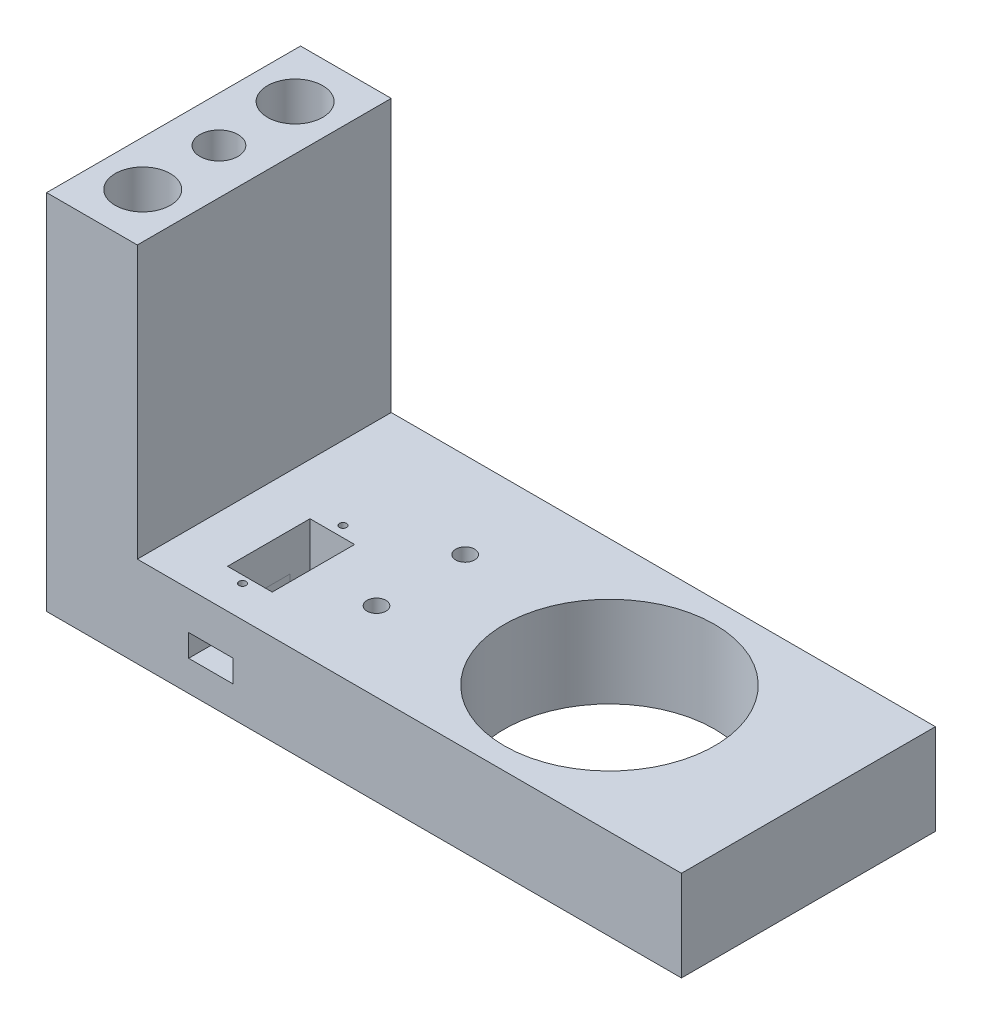
ISO-10303-21;
HEADER;
FILE_DESCRIPTION(('STEP AP214'),'2;1');
FILE_NAME('part.step','',(''),(''),'','','');
FILE_SCHEMA(('AUTOMOTIVE_DESIGN { 1 0 10303 214 1 1 1 1 }'));
ENDSEC;
DATA;
#1=APPLICATION_CONTEXT('core data for automotive mechanical design processes');
#2=APPLICATION_PROTOCOL_DEFINITION('international standard','automotive_design',2000,#1);
#3=PRODUCT_CONTEXT('',#1,'mechanical');
#4=PRODUCT('Part','Part','',(#3));
#5=PRODUCT_RELATED_PRODUCT_CATEGORY('part','',(#4));
#6=PRODUCT_DEFINITION_FORMATION('','',#4);
#7=PRODUCT_DEFINITION_CONTEXT('part definition',#1,'design');
#8=PRODUCT_DEFINITION('design','',#6,#7);
#9=PRODUCT_DEFINITION_SHAPE('','',#8);
#10=(LENGTH_UNIT() NAMED_UNIT(*) SI_UNIT(.MILLI.,.METRE.));
#11=(NAMED_UNIT(*) PLANE_ANGLE_UNIT() SI_UNIT($,.RADIAN.));
#12=(NAMED_UNIT(*) SI_UNIT($,.STERADIAN.) SOLID_ANGLE_UNIT());
#13=UNCERTAINTY_MEASURE_WITH_UNIT(LENGTH_MEASURE(1.E-05),#10,'distance_accuracy_value','');
#14=(GEOMETRIC_REPRESENTATION_CONTEXT(3) GLOBAL_UNCERTAINTY_ASSIGNED_CONTEXT((#13)) GLOBAL_UNIT_ASSIGNED_CONTEXT((#10,
#11,#12)) REPRESENTATION_CONTEXT('',''));
#15=CARTESIAN_POINT('',(0.,0.,0.));
#16=DIRECTION('',(0.,0.,1.));
#17=DIRECTION('',(1.,0.,0.));
#18=AXIS2_PLACEMENT_3D('',#15,#16,#17);
#19=CARTESIAN_POINT('',(162.5,25.,35.));
#20=DIRECTION('',(0.,-1.,0.));
#21=DIRECTION('',(0.,0.,-1.));
#22=AXIS2_PLACEMENT_3D('',#19,#20,#21);
#23=PLANE('',#22);
#24=CARTESIAN_POINT('',(56.60021437,25.,13.16922633));
#25=DIRECTION('',(0.,-1.,0.));
#26=DIRECTION('',(0.,0.,-1.));
#27=AXIS2_PLACEMENT_3D('',#24,#25,#26);
#28=CIRCLE('',#27,2.6);
#29=CARTESIAN_POINT('',(56.60021437,25.,10.56922633));
#30=VERTEX_POINT('',#29);
#31=EDGE_CURVE('E346',#30,#30,#28,.T.);
#32=ORIENTED_EDGE('',*,*,#31,.T.);
#33=EDGE_LOOP('',(#32));
#34=FACE_BOUND('',#33,.T.);
#35=CARTESIAN_POINT('',(56.60021437,25.,-11.27722458));
#36=DIRECTION('',(0.,-1.,0.));
#37=DIRECTION('',(0.,0.,-1.));
#38=AXIS2_PLACEMENT_3D('',#35,#36,#37);
#39=CIRCLE('',#38,2.6);
#40=CARTESIAN_POINT('',(56.60021437,25.,-13.87722458));
#41=VERTEX_POINT('',#40);
#42=EDGE_CURVE('E351',#41,#41,#39,.T.);
#43=ORIENTED_EDGE('',*,*,#42,.T.);
#44=EDGE_LOOP('',(#43));
#45=FACE_BOUND('',#44,.T.);
#46=CARTESIAN_POINT('',(32.8072941842521,25.,-1.39841023109142));
#47=DIRECTION('',(0.,-1.,0.));
#48=DIRECTION('',(0.,0.,-1.));
#49=AXIS2_PLACEMENT_3D('',#46,#47,#48);
#50=CIRCLE('',#49,0.999999999999998);
#51=CARTESIAN_POINT('',(32.8072941842521,25.,-2.39841023109141));
#52=VERTEX_POINT('',#51);
#53=EDGE_CURVE('E197',#52,#52,#50,.T.);
#54=ORIENTED_EDGE('',*,*,#53,.T.);
#55=EDGE_LOOP('',(#54));
#56=FACE_BOUND('',#55,.T.);
#57=CARTESIAN_POINT('',(32.8072941842521,25.,26.3016149524107));
#58=DIRECTION('',(0.,-1.,0.));
#59=DIRECTION('',(0.,0.,-1.));
#60=AXIS2_PLACEMENT_3D('',#57,#58,#59);
#61=CIRCLE('',#60,0.999999999999998);
#62=CARTESIAN_POINT('',(32.8072941842521,25.,25.3016149524107));
#63=VERTEX_POINT('',#62);
#64=EDGE_CURVE('E192',#63,#63,#61,.T.);
#65=ORIENTED_EDGE('',*,*,#64,.T.);
#66=EDGE_LOOP('',(#65));
#67=FACE_BOUND('',#66,.T.);
#68=DIRECTION('',(0.,0.,1.));
#69=VECTOR('',#68,1.);
#70=CARTESIAN_POINT('',(12.5,25.,35.));
#71=LINE('',#70,#69);
#72=CARTESIAN_POINT('',(12.5,25.,-35.));
#73=VERTEX_POINT('',#72);
#74=CARTESIAN_POINT('',(12.5,25.,35.));
#75=VERTEX_POINT('',#74);
#76=EDGE_CURVE('E245',#73,#75,#71,.T.);
#77=ORIENTED_EDGE('',*,*,#76,.T.);
#78=DIRECTION('',(-1.,0.,0.));
#79=VECTOR('',#78,1.);
#80=CARTESIAN_POINT('',(162.5,25.,35.));
#81=LINE('',#80,#79);
#82=CARTESIAN_POINT('',(162.5,25.,35.));
#83=VERTEX_POINT('',#82);
#84=EDGE_CURVE('E252',#83,#75,#81,.T.);
#85=ORIENTED_EDGE('',*,*,#84,.F.);
#86=DIRECTION('',(0.,0.,1.));
#87=VECTOR('',#86,1.);
#88=CARTESIAN_POINT('',(162.5,25.,35.));
#89=LINE('',#88,#87);
#90=CARTESIAN_POINT('',(162.5,25.,-35.));
#91=VERTEX_POINT('',#90);
#92=EDGE_CURVE('E250',#91,#83,#89,.T.);
#93=ORIENTED_EDGE('',*,*,#92,.F.);
#94=DIRECTION('',(-1.,0.,0.));
#95=VECTOR('',#94,1.);
#96=CARTESIAN_POINT('',(162.5,25.,-35.));
#97=LINE('',#96,#95);
#98=EDGE_CURVE('E257',#91,#73,#97,.T.);
#99=ORIENTED_EDGE('',*,*,#98,.T.);
#100=EDGE_LOOP('',(#77,#85,#93,#99));
#101=FACE_BOUND('',#100,.T.);
#102=CARTESIAN_POINT('',(107.66,25.,0.));
#103=DIRECTION('',(0.,-1.,0.));
#104=DIRECTION('',(0.,0.,-1.));
#105=AXIS2_PLACEMENT_3D('',#102,#103,#104);
#106=CIRCLE('',#105,29.);
#107=CARTESIAN_POINT('',(107.66,25.,-29.));
#108=VERTEX_POINT('',#107);
#109=EDGE_CURVE('E240',#108,#108,#106,.T.);
#110=ORIENTED_EDGE('',*,*,#109,.T.);
#111=EDGE_LOOP('',(#110));
#112=FACE_BOUND('',#111,.T.);
#113=DIRECTION('',(-1.,0.,0.));
#114=VECTOR('',#113,1.);
#115=CARTESIAN_POINT('',(162.5,25.,24.2715897689086));
#116=LINE('',#115,#114);
#117=CARTESIAN_POINT('',(38.9572941842524,25.,24.2715897689086));
#118=VERTEX_POINT('',#117);
#119=CARTESIAN_POINT('',(26.6572941842517,25.,24.2715897689086));
#120=VERTEX_POINT('',#119);
#121=EDGE_CURVE('E196',#118,#120,#116,.T.);
#122=ORIENTED_EDGE('',*,*,#121,.T.);
#123=DIRECTION('',(0.,0.,1.));
#124=VECTOR('',#123,1.);
#125=CARTESIAN_POINT('',(26.6572941842517,25.,35.));
#126=LINE('',#125,#124);
#127=CARTESIAN_POINT('',(26.6572941842517,25.,1.55358832804757));
#128=VERTEX_POINT('',#127);
#129=EDGE_CURVE('E219',#128,#120,#126,.T.);
#130=ORIENTED_EDGE('',*,*,#129,.F.);
#131=DIRECTION('',(-1.,0.,0.));
#132=VECTOR('',#131,1.);
#133=CARTESIAN_POINT('',(162.5,25.,1.55358832804757));
#134=LINE('',#133,#132);
#135=CARTESIAN_POINT('',(38.9572941842524,25.,1.55358832804757));
#136=VERTEX_POINT('',#135);
#137=EDGE_CURVE('E222',#136,#128,#134,.T.);
#138=ORIENTED_EDGE('',*,*,#137,.F.);
#139=DIRECTION('',(0.,0.,1.));
#140=VECTOR('',#139,1.);
#141=CARTESIAN_POINT('',(38.9572941842524,25.,35.));
#142=LINE('',#141,#140);
#143=EDGE_CURVE('E208',#136,#118,#142,.T.);
#144=ORIENTED_EDGE('',*,*,#143,.T.);
#145=EDGE_LOOP('',(#122,#130,#138,#144));
#146=FACE_BOUND('',#145,.T.);
#147=ADVANCED_FACE('F36',(#34,#45,#56,#67,#101,#112,#146),#23,.F.);
#148=CARTESIAN_POINT('',(12.5,100.,0.));
#149=DIRECTION('',(1.,0.,0.));
#150=DIRECTION('',(0.,0.,-1.));
#151=AXIS2_PLACEMENT_3D('',#148,#149,#150);
#152=PLANE('',#151);
#153=ORIENTED_EDGE('',*,*,#76,.F.);
#154=DIRECTION('',(0.,-1.,0.));
#155=VECTOR('',#154,1.);
#156=CARTESIAN_POINT('',(12.5,100.,-35.));
#157=LINE('',#156,#155);
#158=CARTESIAN_POINT('',(12.5,100.,-35.));
#159=VERTEX_POINT('',#158);
#160=EDGE_CURVE('E335',#159,#73,#157,.T.);
#161=ORIENTED_EDGE('',*,*,#160,.F.);
#162=DIRECTION('',(0.,0.,1.));
#163=VECTOR('',#162,1.);
#164=CARTESIAN_POINT('',(12.5,100.,0.));
#165=LINE('',#164,#163);
#166=CARTESIAN_POINT('',(12.5,100.,35.));
#167=VERTEX_POINT('',#166);
#168=EDGE_CURVE('E301',#159,#167,#165,.T.);
#169=ORIENTED_EDGE('',*,*,#168,.T.);
#170=DIRECTION('',(0.,-1.,0.));
#171=VECTOR('',#170,1.);
#172=CARTESIAN_POINT('',(12.5,100.,35.));
#173=LINE('',#172,#171);
#174=EDGE_CURVE('E315',#167,#75,#173,.T.);
#175=ORIENTED_EDGE('',*,*,#174,.T.);
#176=EDGE_LOOP('',(#153,#161,#169,#175));
#177=FACE_BOUND('',#176,.T.);
#178=ADVANCED_FACE('F375',(#177),#152,.T.);
#179=CARTESIAN_POINT('',(0.,100.,-35.));
#180=DIRECTION('',(0.,0.,1.));
#181=DIRECTION('',(1.,0.,0.));
#182=AXIS2_PLACEMENT_3D('',#179,#180,#181);
#183=PLANE('',#182);
#184=DIRECTION('',(-1.,0.,0.));
#185=VECTOR('',#184,1.);
#186=CARTESIAN_POINT('',(0.,0.,-35.));
#187=LINE('',#186,#185);
#188=CARTESIAN_POINT('',(162.5,0.,-35.));
#189=VERTEX_POINT('',#188);
#190=CARTESIAN_POINT('',(-12.5,0.,-35.));
#191=VERTEX_POINT('',#190);
#192=EDGE_CURVE('E321',#189,#191,#187,.T.);
#193=ORIENTED_EDGE('',*,*,#192,.T.);
#194=DIRECTION('',(0.,-1.,0.));
#195=VECTOR('',#194,1.);
#196=CARTESIAN_POINT('',(-12.5,100.,-35.));
#197=LINE('',#196,#195);
#198=CARTESIAN_POINT('',(-12.5,100.,-35.));
#199=VERTEX_POINT('',#198);
#200=EDGE_CURVE('E332',#199,#191,#197,.T.);
#201=ORIENTED_EDGE('',*,*,#200,.F.);
#202=DIRECTION('',(-1.,0.,0.));
#203=VECTOR('',#202,1.);
#204=CARTESIAN_POINT('',(0.,100.,-35.));
#205=LINE('',#204,#203);
#206=EDGE_CURVE('E304',#159,#199,#205,.T.);
#207=ORIENTED_EDGE('',*,*,#206,.F.);
#208=ORIENTED_EDGE('',*,*,#160,.T.);
#209=ORIENTED_EDGE('',*,*,#98,.F.);
#210=DIRECTION('',(0.,1.,0.));
#211=VECTOR('',#210,1.);
#212=CARTESIAN_POINT('',(162.5,0.,-35.));
#213=LINE('',#212,#211);
#214=EDGE_CURVE('E248',#189,#91,#213,.T.);
#215=ORIENTED_EDGE('',*,*,#214,.F.);
#216=EDGE_LOOP('',(#193,#201,#207,#208,#209,#215));
#217=FACE_BOUND('',#216,.T.);
#218=ADVANCED_FACE('F380',(#217),#183,.F.);
#219=CARTESIAN_POINT('',(-12.5,100.,0.));
#220=DIRECTION('',(1.,0.,0.));
#221=DIRECTION('',(0.,0.,-1.));
#222=AXIS2_PLACEMENT_3D('',#219,#220,#221);
#223=PLANE('',#222);
#224=DIRECTION('',(0.,0.,1.));
#225=VECTOR('',#224,1.);
#226=CARTESIAN_POINT('',(-12.5,0.,0.));
#227=LINE('',#226,#225);
#228=CARTESIAN_POINT('',(-12.5,0.,35.));
#229=VERTEX_POINT('',#228);
#230=EDGE_CURVE('E324',#191,#229,#227,.T.);
#231=ORIENTED_EDGE('',*,*,#230,.T.);
#232=DIRECTION('',(0.,-1.,0.));
#233=VECTOR('',#232,1.);
#234=CARTESIAN_POINT('',(-12.5,100.,35.));
#235=LINE('',#234,#233);
#236=CARTESIAN_POINT('',(-12.5,100.,35.));
#237=VERTEX_POINT('',#236);
#238=EDGE_CURVE('E330',#237,#229,#235,.T.);
#239=ORIENTED_EDGE('',*,*,#238,.F.);
#240=DIRECTION('',(0.,0.,1.));
#241=VECTOR('',#240,1.);
#242=CARTESIAN_POINT('',(-12.5,100.,0.));
#243=LINE('',#242,#241);
#244=EDGE_CURVE('E307',#199,#237,#243,.T.);
#245=ORIENTED_EDGE('',*,*,#244,.F.);
#246=ORIENTED_EDGE('',*,*,#200,.T.);
#247=EDGE_LOOP('',(#231,#239,#245,#246));
#248=FACE_BOUND('',#247,.T.);
#249=ADVANCED_FACE('F443',(#248),#223,.F.);
#250=CARTESIAN_POINT('',(0.,100.,35.));
#251=DIRECTION('',(0.,0.,1.));
#252=DIRECTION('',(1.,0.,0.));
#253=AXIS2_PLACEMENT_3D('',#250,#251,#252);
#254=PLANE('',#253);
#255=DIRECTION('',(1.,0.,0.));
#256=VECTOR('',#255,1.);
#257=CARTESIAN_POINT('',(0.,8.4,35.));
#258=LINE('',#257,#256);
#259=CARTESIAN_POINT('',(26.65,8.4,35.));
#260=VERTEX_POINT('',#259);
#261=CARTESIAN_POINT('',(38.85,8.4,35.));
#262=VERTEX_POINT('',#261);
#263=EDGE_CURVE('E53',#260,#262,#258,.T.);
#264=ORIENTED_EDGE('',*,*,#263,.F.);
#265=DIRECTION('',(0.,1.,0.));
#266=VECTOR('',#265,1.);
#267=CARTESIAN_POINT('',(26.65,100.,35.));
#268=LINE('',#267,#266);
#269=CARTESIAN_POINT('',(26.65,14.56,35.));
#270=VERTEX_POINT('',#269);
#271=EDGE_CURVE('E174',#260,#270,#268,.T.);
#272=ORIENTED_EDGE('',*,*,#271,.T.);
#273=DIRECTION('',(1.,0.,0.));
#274=VECTOR('',#273,1.);
#275=CARTESIAN_POINT('',(0.,14.56,35.));
#276=LINE('',#275,#274);
#277=CARTESIAN_POINT('',(38.85,14.56,35.));
#278=VERTEX_POINT('',#277);
#279=EDGE_CURVE('E166',#270,#278,#276,.T.);
#280=ORIENTED_EDGE('',*,*,#279,.T.);
#281=DIRECTION('',(0.,1.,0.));
#282=VECTOR('',#281,1.);
#283=CARTESIAN_POINT('',(38.85,100.,35.));
#284=LINE('',#283,#282);
#285=EDGE_CURVE('E179',#262,#278,#284,.T.);
#286=ORIENTED_EDGE('',*,*,#285,.F.);
#287=EDGE_LOOP('',(#264,#272,#280,#286));
#288=FACE_BOUND('',#287,.T.);
#289=DIRECTION('',(-1.,0.,0.));
#290=VECTOR('',#289,1.);
#291=CARTESIAN_POINT('',(0.,0.,35.));
#292=LINE('',#291,#290);
#293=CARTESIAN_POINT('',(162.5,0.,35.));
#294=VERTEX_POINT('',#293);
#295=EDGE_CURVE('E298',#294,#229,#292,.T.);
#296=ORIENTED_EDGE('',*,*,#295,.F.);
#297=DIRECTION('',(0.,-1.,0.));
#298=VECTOR('',#297,1.);
#299=CARTESIAN_POINT('',(162.5,0.,35.));
#300=LINE('',#299,#298);
#301=EDGE_CURVE('E241',#83,#294,#300,.T.);
#302=ORIENTED_EDGE('',*,*,#301,.F.);
#303=ORIENTED_EDGE('',*,*,#84,.T.);
#304=ORIENTED_EDGE('',*,*,#174,.F.);
#305=DIRECTION('',(-1.,0.,0.));
#306=VECTOR('',#305,1.);
#307=CARTESIAN_POINT('',(0.,100.,35.));
#308=LINE('',#307,#306);
#309=EDGE_CURVE('E309',#167,#237,#308,.T.);
#310=ORIENTED_EDGE('',*,*,#309,.T.);
#311=ORIENTED_EDGE('',*,*,#238,.T.);
#312=EDGE_LOOP('',(#296,#302,#303,#304,#310,#311));
#313=FACE_BOUND('',#312,.T.);
#314=ADVANCED_FACE('F439',(#288,#313),#254,.T.);
#315=CARTESIAN_POINT('',(0.,100.,-21.));
#316=DIRECTION('',(0.,-1.,0.));
#317=DIRECTION('',(0.,0.,-1.));
#318=AXIS2_PLACEMENT_3D('',#315,#316,#317);
#319=CYLINDRICAL_SURFACE('',#318,7.6);
#320=CARTESIAN_POINT('',(0.,100.,-21.));
#321=DIRECTION('',(0.,1.,0.));
#322=DIRECTION('',(0.,0.,1.));
#323=AXIS2_PLACEMENT_3D('',#320,#321,#322);
#324=CIRCLE('',#323,7.6);
#325=CARTESIAN_POINT('',(0.,100.,-13.4));
#326=VERTEX_POINT('',#325);
#327=EDGE_CURVE('E297',#326,#326,#324,.T.);
#328=ORIENTED_EDGE('',*,*,#327,.T.);
#329=EDGE_LOOP('',(#328));
#330=FACE_BOUND('',#329,.T.);
#331=CARTESIAN_POINT('',(0.,0.,-21.));
#332=DIRECTION('',(0.,1.,0.));
#333=DIRECTION('',(0.,0.,1.));
#334=AXIS2_PLACEMENT_3D('',#331,#332,#333);
#335=CIRCLE('',#334,7.6);
#336=CARTESIAN_POINT('',(0.,0.,-13.4));
#337=VERTEX_POINT('',#336);
#338=EDGE_CURVE('E318',#337,#337,#335,.T.);
#339=ORIENTED_EDGE('',*,*,#338,.F.);
#340=EDGE_LOOP('',(#339));
#341=FACE_BOUND('',#340,.T.);
#342=ADVANCED_FACE('F442',(#330,#341),#319,.F.);
#343=CARTESIAN_POINT('',(0.,100.,21.));
#344=DIRECTION('',(0.,-1.,0.));
#345=DIRECTION('',(0.,0.,-1.));
#346=AXIS2_PLACEMENT_3D('',#343,#344,#345);
#347=CYLINDRICAL_SURFACE('',#346,7.60000000000001);
#348=CARTESIAN_POINT('',(0.,100.,21.));
#349=DIRECTION('',(0.,1.,0.));
#350=DIRECTION('',(0.,0.,1.));
#351=AXIS2_PLACEMENT_3D('',#348,#349,#350);
#352=CIRCLE('',#351,7.60000000000001);
#353=CARTESIAN_POINT('',(0.,100.,28.6));
#354=VERTEX_POINT('',#353);
#355=EDGE_CURVE('E294',#354,#354,#352,.T.);
#356=ORIENTED_EDGE('',*,*,#355,.T.);
#357=EDGE_LOOP('',(#356));
#358=FACE_BOUND('',#357,.T.);
#359=CARTESIAN_POINT('',(0.,0.,21.));
#360=DIRECTION('',(0.,1.,0.));
#361=DIRECTION('',(0.,0.,1.));
#362=AXIS2_PLACEMENT_3D('',#359,#360,#361);
#363=CIRCLE('',#362,7.60000000000001);
#364=CARTESIAN_POINT('',(0.,0.,28.6));
#365=VERTEX_POINT('',#364);
#366=EDGE_CURVE('E285',#365,#365,#363,.T.);
#367=ORIENTED_EDGE('',*,*,#366,.F.);
#368=EDGE_LOOP('',(#367));
#369=FACE_BOUND('',#368,.T.);
#370=ADVANCED_FACE('F38',(#358,#369),#347,.F.);
#371=CARTESIAN_POINT('',(0.,100.,0.));
#372=DIRECTION('',(0.,-1.,0.));
#373=DIRECTION('',(0.,0.,-1.));
#374=AXIS2_PLACEMENT_3D('',#371,#372,#373);
#375=CYLINDRICAL_SURFACE('',#374,5.25);
#376=CARTESIAN_POINT('',(0.,3.5,0.));
#377=DIRECTION('',(0.,1.,0.));
#378=DIRECTION('',(0.,0.,1.));
#379=AXIS2_PLACEMENT_3D('',#376,#377,#378);
#380=CIRCLE('',#379,5.25);
#381=CARTESIAN_POINT('',(0.,3.5,5.25));
#382=VERTEX_POINT('',#381);
#383=EDGE_CURVE('E273',#382,#382,#380,.T.);
#384=ORIENTED_EDGE('',*,*,#383,.F.);
#385=EDGE_LOOP('',(#384));
#386=FACE_BOUND('',#385,.T.);
#387=CARTESIAN_POINT('',(0.,100.,0.));
#388=DIRECTION('',(0.,1.,0.));
#389=DIRECTION('',(0.,0.,1.));
#390=AXIS2_PLACEMENT_3D('',#387,#388,#389);
#391=CIRCLE('',#390,5.25);
#392=CARTESIAN_POINT('',(0.,100.,5.25));
#393=VERTEX_POINT('',#392);
#394=EDGE_CURVE('E312',#393,#393,#391,.T.);
#395=ORIENTED_EDGE('',*,*,#394,.T.);
#396=EDGE_LOOP('',(#395));
#397=FACE_BOUND('',#396,.T.);
#398=ADVANCED_FACE('F431',(#386,#397),#375,.F.);
#399=CARTESIAN_POINT('',(0.,100.,0.));
#400=DIRECTION('',(0.,1.,0.));
#401=DIRECTION('',(0.,0.,1.));
#402=AXIS2_PLACEMENT_3D('',#399,#400,#401);
#403=PLANE('',#402);
#404=ORIENTED_EDGE('',*,*,#355,.F.);
#405=EDGE_LOOP('',(#404));
#406=FACE_BOUND('',#405,.T.);
#407=ORIENTED_EDGE('',*,*,#327,.F.);
#408=EDGE_LOOP('',(#407));
#409=FACE_BOUND('',#408,.T.);
#410=ORIENTED_EDGE('',*,*,#168,.F.);
#411=ORIENTED_EDGE('',*,*,#206,.T.);
#412=ORIENTED_EDGE('',*,*,#244,.T.);
#413=ORIENTED_EDGE('',*,*,#309,.F.);
#414=EDGE_LOOP('',(#410,#411,#412,#413));
#415=FACE_BOUND('',#414,.T.);
#416=ORIENTED_EDGE('',*,*,#394,.F.);
#417=EDGE_LOOP('',(#416));
#418=FACE_BOUND('',#417,.T.);
#419=ADVANCED_FACE('F428',(#406,#409,#415,#418),#403,.T.);
#420=CARTESIAN_POINT('',(0.,0.,0.));
#421=DIRECTION('',(0.,1.,0.));
#422=DIRECTION('',(0.,0.,1.));
#423=AXIS2_PLACEMENT_3D('',#420,#421,#422);
#424=PLANE('',#423);
#425=CARTESIAN_POINT('',(56.60021437,0.,13.16922633));
#426=DIRECTION('',(0.,1.,0.));
#427=DIRECTION('',(0.,0.,1.));
#428=AXIS2_PLACEMENT_3D('',#425,#426,#427);
#429=CIRCLE('',#428,2.6);
#430=CARTESIAN_POINT('',(56.60021437,0.,15.76922633));
#431=VERTEX_POINT('',#430);
#432=EDGE_CURVE('E40',#431,#431,#429,.F.);
#433=ORIENTED_EDGE('',*,*,#432,.F.);
#434=EDGE_LOOP('',(#433));
#435=FACE_BOUND('',#434,.T.);
#436=CARTESIAN_POINT('',(56.60021437,0.,-11.27722458));
#437=DIRECTION('',(0.,1.,0.));
#438=DIRECTION('',(0.,0.,1.));
#439=AXIS2_PLACEMENT_3D('',#436,#437,#438);
#440=CIRCLE('',#439,2.6);
#441=CARTESIAN_POINT('',(56.60021437,0.,-8.67722458));
#442=VERTEX_POINT('',#441);
#443=EDGE_CURVE('E344',#442,#442,#440,.F.);
#444=ORIENTED_EDGE('',*,*,#443,.F.);
#445=EDGE_LOOP('',(#444));
#446=FACE_BOUND('',#445,.T.);
#447=CARTESIAN_POINT('',(107.66,0.,0.));
#448=DIRECTION('',(0.,-1.,0.));
#449=DIRECTION('',(0.,0.,-1.));
#450=AXIS2_PLACEMENT_3D('',#447,#448,#449);
#451=CIRCLE('',#450,29.);
#452=CARTESIAN_POINT('',(107.66,0.,-29.));
#453=VERTEX_POINT('',#452);
#454=EDGE_CURVE('E237',#453,#453,#451,.T.);
#455=ORIENTED_EDGE('',*,*,#454,.F.);
#456=EDGE_LOOP('',(#455));
#457=FACE_BOUND('',#456,.T.);
#458=CARTESIAN_POINT('',(0.,0.,0.));
#459=DIRECTION('',(0.,1.,0.));
#460=DIRECTION('',(0.,0.,1.));
#461=AXIS2_PLACEMENT_3D('',#458,#459,#460);
#462=CIRCLE('',#461,11.15);
#463=CARTESIAN_POINT('',(0.,0.,11.15));
#464=VERTEX_POINT('',#463);
#465=EDGE_CURVE('E260',#464,#464,#462,.T.);
#466=ORIENTED_EDGE('',*,*,#465,.T.);
#467=EDGE_LOOP('',(#466));
#468=FACE_BOUND('',#467,.T.);
#469=ORIENTED_EDGE('',*,*,#366,.T.);
#470=EDGE_LOOP('',(#469));
#471=FACE_BOUND('',#470,.T.);
#472=ORIENTED_EDGE('',*,*,#338,.T.);
#473=EDGE_LOOP('',(#472));
#474=FACE_BOUND('',#473,.T.);
#475=ORIENTED_EDGE('',*,*,#192,.F.);
#476=DIRECTION('',(0.,0.,-1.));
#477=VECTOR('',#476,1.);
#478=CARTESIAN_POINT('',(162.5,0.,35.));
#479=LINE('',#478,#477);
#480=EDGE_CURVE('E244',#294,#189,#479,.T.);
#481=ORIENTED_EDGE('',*,*,#480,.F.);
#482=ORIENTED_EDGE('',*,*,#295,.T.);
#483=ORIENTED_EDGE('',*,*,#230,.F.);
#484=EDGE_LOOP('',(#475,#481,#482,#483));
#485=FACE_BOUND('',#484,.T.);
#486=ADVANCED_FACE('F395',(#435,#446,#457,#468,#471,#474,#485),#424,.F.);
#487=CARTESIAN_POINT('',(0.,3.5,0.));
#488=DIRECTION('',(0.,-1.,0.));
#489=DIRECTION('',(0.,0.,-1.));
#490=AXIS2_PLACEMENT_3D('',#487,#488,#489);
#491=CYLINDRICAL_SURFACE('',#490,11.15);
#492=CARTESIAN_POINT('',(0.,3.5,0.));
#493=DIRECTION('',(0.,1.,0.));
#494=DIRECTION('',(0.,0.,1.));
#495=AXIS2_PLACEMENT_3D('',#492,#493,#494);
#496=CIRCLE('',#495,11.15);
#497=CARTESIAN_POINT('',(0.,3.5,11.15));
#498=VERTEX_POINT('',#497);
#499=EDGE_CURVE('E276',#498,#498,#496,.T.);
#500=ORIENTED_EDGE('',*,*,#499,.T.);
#501=EDGE_LOOP('',(#500));
#502=FACE_BOUND('',#501,.T.);
#503=ORIENTED_EDGE('',*,*,#465,.F.);
#504=EDGE_LOOP('',(#503));
#505=FACE_BOUND('',#504,.T.);
#506=ADVANCED_FACE('F391',(#502,#505),#491,.F.);
#507=CARTESIAN_POINT('',(0.,3.5,0.));
#508=DIRECTION('',(0.,1.,0.));
#509=DIRECTION('',(0.,0.,1.));
#510=AXIS2_PLACEMENT_3D('',#507,#508,#509);
#511=PLANE('',#510);
#512=CARTESIAN_POINT('',(0.,3.5,-8.19373296584723));
#513=DIRECTION('',(0.,1.,0.));
#514=DIRECTION('',(0.,0.,1.));
#515=AXIS2_PLACEMENT_3D('',#512,#513,#514);
#516=CIRCLE('',#515,1.575);
#517=CARTESIAN_POINT('',(0.,3.5,-6.61873296584723));
#518=VERTEX_POINT('',#517);
#519=EDGE_CURVE('E261',#518,#518,#516,.T.);
#520=ORIENTED_EDGE('',*,*,#519,.T.);
#521=EDGE_LOOP('',(#520));
#522=FACE_BOUND('',#521,.T.);
#523=CARTESIAN_POINT('',(-8.19373296584723,3.5,0.));
#524=DIRECTION('',(0.,1.,0.));
#525=DIRECTION('',(0.,0.,1.));
#526=AXIS2_PLACEMENT_3D('',#523,#524,#525);
#527=CIRCLE('',#526,1.575);
#528=CARTESIAN_POINT('',(-8.19373296584723,3.5,1.57499999999991));
#529=VERTEX_POINT('',#528);
#530=EDGE_CURVE('E264',#529,#529,#527,.T.);
#531=ORIENTED_EDGE('',*,*,#530,.T.);
#532=EDGE_LOOP('',(#531));
#533=FACE_BOUND('',#532,.T.);
#534=CARTESIAN_POINT('',(0.,3.5,8.19373296584723));
#535=DIRECTION('',(0.,1.,0.));
#536=DIRECTION('',(0.,0.,1.));
#537=AXIS2_PLACEMENT_3D('',#534,#535,#536);
#538=CIRCLE('',#537,1.575);
#539=CARTESIAN_POINT('',(0.,3.5,9.76873296584723));
#540=VERTEX_POINT('',#539);
#541=EDGE_CURVE('E267',#540,#540,#538,.T.);
#542=ORIENTED_EDGE('',*,*,#541,.T.);
#543=EDGE_LOOP('',(#542));
#544=FACE_BOUND('',#543,.T.);
#545=CARTESIAN_POINT('',(8.19373296584723,3.5,0.));
#546=DIRECTION('',(0.,1.,0.));
#547=DIRECTION('',(0.,0.,1.));
#548=AXIS2_PLACEMENT_3D('',#545,#546,#547);
#549=CIRCLE('',#548,1.575);
#550=CARTESIAN_POINT('',(8.19373296584723,3.5,1.57500000000003));
#551=VERTEX_POINT('',#550);
#552=EDGE_CURVE('E270',#551,#551,#549,.T.);
#553=ORIENTED_EDGE('',*,*,#552,.T.);
#554=EDGE_LOOP('',(#553));
#555=FACE_BOUND('',#554,.T.);
#556=ORIENTED_EDGE('',*,*,#383,.T.);
#557=EDGE_LOOP('',(#556));
#558=FACE_BOUND('',#557,.T.);
#559=ORIENTED_EDGE('',*,*,#499,.F.);
#560=EDGE_LOOP('',(#559));
#561=FACE_BOUND('',#560,.T.);
#562=ADVANCED_FACE('F387',(#522,#533,#544,#555,#558,#561),#511,.F.);
#563=CARTESIAN_POINT('',(0.,12.8,0.));
#564=DIRECTION('',(0.,1.,0.));
#565=DIRECTION('',(0.,0.,1.));
#566=AXIS2_PLACEMENT_3D('',#563,#564,#565);
#567=PLANE('',#566);
#568=CARTESIAN_POINT('',(0.,12.8,-8.19373296584723));
#569=DIRECTION('',(0.,1.,0.));
#570=DIRECTION('',(0.,0.,1.));
#571=AXIS2_PLACEMENT_3D('',#568,#569,#570);
#572=CIRCLE('',#571,1.575);
#573=CARTESIAN_POINT('',(0.,12.8,-6.61873296584723));
#574=VERTEX_POINT('',#573);
#575=EDGE_CURVE('E286',#574,#574,#572,.T.);
#576=ORIENTED_EDGE('',*,*,#575,.F.);
#577=EDGE_LOOP('',(#576));
#578=FACE_BOUND('',#577,.T.);
#579=ADVANCED_FACE('F390',(#578),#567,.F.);
#580=CARTESIAN_POINT('',(0.,12.8,-8.19373296584723));
#581=DIRECTION('',(0.,-1.,0.));
#582=DIRECTION('',(0.,0.,-1.));
#583=AXIS2_PLACEMENT_3D('',#580,#581,#582);
#584=CYLINDRICAL_SURFACE('',#583,1.575);
#585=ORIENTED_EDGE('',*,*,#519,.F.);
#586=EDGE_LOOP('',(#585));
#587=FACE_BOUND('',#586,.T.);
#588=ORIENTED_EDGE('',*,*,#575,.T.);
#589=EDGE_LOOP('',(#588));
#590=FACE_BOUND('',#589,.T.);
#591=ADVANCED_FACE('F408',(#587,#590),#584,.F.);
#592=CARTESIAN_POINT('',(0.,12.8,0.));
#593=DIRECTION('',(0.,1.,0.));
#594=DIRECTION('',(0.,0.,1.));
#595=AXIS2_PLACEMENT_3D('',#592,#593,#594);
#596=PLANE('',#595);
#597=CARTESIAN_POINT('',(-8.19373296584723,12.8,0.));
#598=DIRECTION('',(0.,1.,0.));
#599=DIRECTION('',(0.,0.,1.));
#600=AXIS2_PLACEMENT_3D('',#597,#598,#599);
#601=CIRCLE('',#600,1.575);
#602=CARTESIAN_POINT('',(-8.19373296584723,12.8,1.57499999999991));
#603=VERTEX_POINT('',#602);
#604=EDGE_CURVE('E289',#603,#603,#601,.T.);
#605=ORIENTED_EDGE('',*,*,#604,.F.);
#606=EDGE_LOOP('',(#605));
#607=FACE_BOUND('',#606,.T.);
#608=ADVANCED_FACE('F412',(#607),#596,.F.);
#609=CARTESIAN_POINT('',(-8.19373296584723,12.8,0.));
#610=DIRECTION('',(0.,-1.,0.));
#611=DIRECTION('',(0.,0.,-1.));
#612=AXIS2_PLACEMENT_3D('',#609,#610,#611);
#613=CYLINDRICAL_SURFACE('',#612,1.575);
#614=ORIENTED_EDGE('',*,*,#530,.F.);
#615=EDGE_LOOP('',(#614));
#616=FACE_BOUND('',#615,.T.);
#617=ORIENTED_EDGE('',*,*,#604,.T.);
#618=EDGE_LOOP('',(#617));
#619=FACE_BOUND('',#618,.T.);
#620=ADVANCED_FACE('F416',(#616,#619),#613,.F.);
#621=CARTESIAN_POINT('',(0.,12.8,0.));
#622=DIRECTION('',(0.,1.,0.));
#623=DIRECTION('',(0.,0.,1.));
#624=AXIS2_PLACEMENT_3D('',#621,#622,#623);
#625=PLANE('',#624);
#626=CARTESIAN_POINT('',(8.19373296584723,12.8,0.));
#627=DIRECTION('',(0.,1.,0.));
#628=DIRECTION('',(0.,0.,1.));
#629=AXIS2_PLACEMENT_3D('',#626,#627,#628);
#630=CIRCLE('',#629,1.575);
#631=CARTESIAN_POINT('',(8.19373296584723,12.8,1.57500000000003));
#632=VERTEX_POINT('',#631);
#633=EDGE_CURVE('E279',#632,#632,#630,.T.);
#634=ORIENTED_EDGE('',*,*,#633,.F.);
#635=EDGE_LOOP('',(#634));
#636=FACE_BOUND('',#635,.T.);
#637=ADVANCED_FACE('F420',(#636),#625,.F.);
#638=CARTESIAN_POINT('',(8.19373296584723,12.8,0.));
#639=DIRECTION('',(0.,-1.,0.));
#640=DIRECTION('',(0.,0.,-1.));
#641=AXIS2_PLACEMENT_3D('',#638,#639,#640);
#642=CYLINDRICAL_SURFACE('',#641,1.575);
#643=ORIENTED_EDGE('',*,*,#552,.F.);
#644=EDGE_LOOP('',(#643));
#645=FACE_BOUND('',#644,.T.);
#646=ORIENTED_EDGE('',*,*,#633,.T.);
#647=EDGE_LOOP('',(#646));
#648=FACE_BOUND('',#647,.T.);
#649=ADVANCED_FACE('F401',(#645,#648),#642,.F.);
#650=CARTESIAN_POINT('',(0.,12.8,0.));
#651=DIRECTION('',(0.,1.,0.));
#652=DIRECTION('',(0.,0.,1.));
#653=AXIS2_PLACEMENT_3D('',#650,#651,#652);
#654=PLANE('',#653);
#655=CARTESIAN_POINT('',(0.,12.8,8.19373296584723));
#656=DIRECTION('',(0.,1.,0.));
#657=DIRECTION('',(0.,0.,1.));
#658=AXIS2_PLACEMENT_3D('',#655,#656,#657);
#659=CIRCLE('',#658,1.575);
#660=CARTESIAN_POINT('',(0.,12.8,9.76873296584723));
#661=VERTEX_POINT('',#660);
#662=EDGE_CURVE('E282',#661,#661,#659,.T.);
#663=ORIENTED_EDGE('',*,*,#662,.F.);
#664=EDGE_LOOP('',(#663));
#665=FACE_BOUND('',#664,.T.);
#666=ADVANCED_FACE('F397',(#665),#654,.F.);
#667=CARTESIAN_POINT('',(0.,12.8,8.19373296584723));
#668=DIRECTION('',(0.,-1.,0.));
#669=DIRECTION('',(0.,0.,-1.));
#670=AXIS2_PLACEMENT_3D('',#667,#668,#669);
#671=CYLINDRICAL_SURFACE('',#670,1.575);
#672=ORIENTED_EDGE('',*,*,#541,.F.);
#673=EDGE_LOOP('',(#672));
#674=FACE_BOUND('',#673,.T.);
#675=ORIENTED_EDGE('',*,*,#662,.T.);
#676=EDGE_LOOP('',(#675));
#677=FACE_BOUND('',#676,.T.);
#678=ADVANCED_FACE('F400',(#674,#677),#671,.F.);
#679=CARTESIAN_POINT('',(162.5,0.,0.));
#680=DIRECTION('',(-1.,0.,0.));
#681=DIRECTION('',(0.,0.,1.));
#682=AXIS2_PLACEMENT_3D('',#679,#680,#681);
#683=PLANE('',#682);
#684=ORIENTED_EDGE('',*,*,#301,.T.);
#685=ORIENTED_EDGE('',*,*,#480,.T.);
#686=ORIENTED_EDGE('',*,*,#214,.T.);
#687=ORIENTED_EDGE('',*,*,#92,.T.);
#688=EDGE_LOOP('',(#684,#685,#686,#687));
#689=FACE_BOUND('',#688,.T.);
#690=ADVANCED_FACE('F385',(#689),#683,.F.);
#691=CARTESIAN_POINT('',(107.66,30.,0.));
#692=DIRECTION('',(0.,-1.,0.));
#693=DIRECTION('',(0.,0.,-1.));
#694=AXIS2_PLACEMENT_3D('',#691,#692,#693);
#695=CYLINDRICAL_SURFACE('',#694,29.);
#696=ORIENTED_EDGE('',*,*,#454,.T.);
#697=EDGE_LOOP('',(#696));
#698=FACE_BOUND('',#697,.T.);
#699=ORIENTED_EDGE('',*,*,#109,.F.);
#700=EDGE_LOOP('',(#699));
#701=FACE_BOUND('',#700,.T.);
#702=ADVANCED_FACE('F541',(#698,#701),#695,.F.);
#703=CARTESIAN_POINT('',(162.5,3.,24.2715897689086));
#704=DIRECTION('',(0.,0.,-1.));
#705=DIRECTION('',(-1.,0.,0.));
#706=AXIS2_PLACEMENT_3D('',#703,#704,#705);
#707=PLANE('',#706);
#708=DIRECTION('',(-1.,0.,0.));
#709=VECTOR('',#708,1.);
#710=CARTESIAN_POINT('',(162.5,8.4,24.2715897689086));
#711=LINE('',#710,#709);
#712=CARTESIAN_POINT('',(38.85,8.4,24.2715897689086));
#713=VERTEX_POINT('',#712);
#714=CARTESIAN_POINT('',(26.6572941842517,8.4,24.2715897689086));
#715=VERTEX_POINT('',#714);
#716=EDGE_CURVE('E190',#713,#715,#711,.T.);
#717=ORIENTED_EDGE('',*,*,#716,.F.);
#718=DIRECTION('',(0.,-1.,0.));
#719=VECTOR('',#718,1.);
#720=CARTESIAN_POINT('',(38.85,3.,24.2715897689086));
#721=LINE('',#720,#719);
#722=CARTESIAN_POINT('',(38.85,14.56,24.2715897689086));
#723=VERTEX_POINT('',#722);
#724=EDGE_CURVE('E11',#723,#713,#721,.T.);
#725=ORIENTED_EDGE('',*,*,#724,.F.);
#726=DIRECTION('',(-1.,0.,0.));
#727=VECTOR('',#726,1.);
#728=CARTESIAN_POINT('',(162.5,14.56,24.2715897689086));
#729=LINE('',#728,#727);
#730=CARTESIAN_POINT('',(26.6572941842517,14.56,24.2715897689086));
#731=VERTEX_POINT('',#730);
#732=EDGE_CURVE('E184',#723,#731,#729,.T.);
#733=ORIENTED_EDGE('',*,*,#732,.T.);
#734=DIRECTION('',(0.,1.,0.));
#735=VECTOR('',#734,1.);
#736=CARTESIAN_POINT('',(26.6572941842517,3.,24.2715897689086));
#737=LINE('',#736,#735);
#738=EDGE_CURVE('E233',#731,#120,#737,.T.);
#739=ORIENTED_EDGE('',*,*,#738,.T.);
#740=ORIENTED_EDGE('',*,*,#121,.F.);
#741=DIRECTION('',(0.,1.,0.));
#742=VECTOR('',#741,1.);
#743=CARTESIAN_POINT('',(38.9572941842524,3.,24.2715897689086));
#744=LINE('',#743,#742);
#745=CARTESIAN_POINT('',(38.9572941842524,3.,24.2715897689086));
#746=VERTEX_POINT('',#745);
#747=EDGE_CURVE('E216',#746,#118,#744,.T.);
#748=ORIENTED_EDGE('',*,*,#747,.F.);
#749=DIRECTION('',(-1.,0.,0.));
#750=VECTOR('',#749,1.);
#751=CARTESIAN_POINT('',(162.5,3.,24.2715897689086));
#752=LINE('',#751,#750);
#753=CARTESIAN_POINT('',(26.6572941842517,3.,24.2715897689086));
#754=VERTEX_POINT('',#753);
#755=EDGE_CURVE('E205',#746,#754,#752,.T.);
#756=ORIENTED_EDGE('',*,*,#755,.T.);
#757=EDGE_CURVE('E234',#754,#715,#737,.T.);
#758=ORIENTED_EDGE('',*,*,#757,.T.);
#759=EDGE_LOOP('',(#717,#725,#733,#739,#740,#748,#756,#758));
#760=FACE_BOUND('',#759,.T.);
#761=ADVANCED_FACE('F488',(#760),#707,.T.);
#762=CARTESIAN_POINT('',(26.6572941842517,3.,35.));
#763=DIRECTION('',(-1.,0.,0.));
#764=DIRECTION('',(0.,0.,1.));
#765=AXIS2_PLACEMENT_3D('',#762,#763,#764);
#766=PLANE('',#765);
#767=DIRECTION('',(0.,1.,0.));
#768=VECTOR('',#767,1.);
#769=CARTESIAN_POINT('',(26.6572941842517,3.,6.99999999999996));
#770=LINE('',#769,#768);
#771=CARTESIAN_POINT('',(26.6572941842517,8.4,6.99999999999996));
#772=VERTEX_POINT('',#771);
#773=CARTESIAN_POINT('',(26.6572941842517,14.56,6.99999999999996));
#774=VERTEX_POINT('',#773);
#775=EDGE_CURVE('E172',#772,#774,#770,.T.);
#776=ORIENTED_EDGE('',*,*,#775,.F.);
#777=DIRECTION('',(0.,0.,1.));
#778=VECTOR('',#777,1.);
#779=CARTESIAN_POINT('',(26.6572941842517,8.4,35.));
#780=LINE('',#779,#778);
#781=EDGE_CURVE('E45',#772,#715,#780,.T.);
#782=ORIENTED_EDGE('',*,*,#781,.T.);
#783=ORIENTED_EDGE('',*,*,#757,.F.);
#784=DIRECTION('',(0.,0.,1.));
#785=VECTOR('',#784,1.);
#786=CARTESIAN_POINT('',(26.6572941842517,3.,35.));
#787=LINE('',#786,#785);
#788=CARTESIAN_POINT('',(26.6572941842517,3.,1.55358832804757));
#789=VERTEX_POINT('',#788);
#790=EDGE_CURVE('E207',#789,#754,#787,.T.);
#791=ORIENTED_EDGE('',*,*,#790,.F.);
#792=DIRECTION('',(0.,1.,0.));
#793=VECTOR('',#792,1.);
#794=CARTESIAN_POINT('',(26.6572941842517,3.,1.55358832804757));
#795=LINE('',#794,#793);
#796=EDGE_CURVE('E231',#789,#128,#795,.T.);
#797=ORIENTED_EDGE('',*,*,#796,.T.);
#798=ORIENTED_EDGE('',*,*,#129,.T.);
#799=ORIENTED_EDGE('',*,*,#738,.F.);
#800=DIRECTION('',(0.,0.,1.));
#801=VECTOR('',#800,1.);
#802=CARTESIAN_POINT('',(26.6572941842517,14.56,35.));
#803=LINE('',#802,#801);
#804=EDGE_CURVE('E341',#774,#731,#803,.T.);
#805=ORIENTED_EDGE('',*,*,#804,.F.);
#806=EDGE_LOOP('',(#776,#782,#783,#791,#797,#798,#799,#805));
#807=FACE_BOUND('',#806,.T.);
#808=ADVANCED_FACE('F502',(#807),#766,.F.);
#809=CARTESIAN_POINT('',(162.5,3.,1.55358832804757));
#810=DIRECTION('',(0.,0.,-1.));
#811=DIRECTION('',(-1.,0.,0.));
#812=AXIS2_PLACEMENT_3D('',#809,#810,#811);
#813=PLANE('',#812);
#814=ORIENTED_EDGE('',*,*,#137,.T.);
#815=ORIENTED_EDGE('',*,*,#796,.F.);
#816=DIRECTION('',(-1.,0.,0.));
#817=VECTOR('',#816,1.);
#818=CARTESIAN_POINT('',(162.5,3.,1.55358832804757));
#819=LINE('',#818,#817);
#820=CARTESIAN_POINT('',(38.9572941842524,3.,1.55358832804757));
#821=VERTEX_POINT('',#820);
#822=EDGE_CURVE('E211',#821,#789,#819,.T.);
#823=ORIENTED_EDGE('',*,*,#822,.F.);
#824=DIRECTION('',(0.,1.,0.));
#825=VECTOR('',#824,1.);
#826=CARTESIAN_POINT('',(38.9572941842524,3.,1.55358832804757));
#827=LINE('',#826,#825);
#828=EDGE_CURVE('E229',#821,#136,#827,.T.);
#829=ORIENTED_EDGE('',*,*,#828,.T.);
#830=EDGE_LOOP('',(#814,#815,#823,#829));
#831=FACE_BOUND('',#830,.T.);
#832=ADVANCED_FACE('F498',(#831),#813,.F.);
#833=CARTESIAN_POINT('',(38.9572941842524,3.,35.));
#834=DIRECTION('',(-1.,0.,0.));
#835=DIRECTION('',(0.,0.,1.));
#836=AXIS2_PLACEMENT_3D('',#833,#834,#835);
#837=PLANE('',#836);
#838=ORIENTED_EDGE('',*,*,#143,.F.);
#839=ORIENTED_EDGE('',*,*,#828,.F.);
#840=DIRECTION('',(0.,0.,1.));
#841=VECTOR('',#840,1.);
#842=CARTESIAN_POINT('',(38.9572941842524,3.,35.));
#843=LINE('',#842,#841);
#844=EDGE_CURVE('E214',#821,#746,#843,.T.);
#845=ORIENTED_EDGE('',*,*,#844,.T.);
#846=ORIENTED_EDGE('',*,*,#747,.T.);
#847=EDGE_LOOP('',(#838,#839,#845,#846));
#848=FACE_BOUND('',#847,.T.);
#849=ADVANCED_FACE('F492',(#848),#837,.T.);
#850=CARTESIAN_POINT('',(0.,3.,0.));
#851=DIRECTION('',(0.,1.,0.));
#852=DIRECTION('',(0.,0.,1.));
#853=AXIS2_PLACEMENT_3D('',#850,#851,#852);
#854=PLANE('',#853);
#855=ORIENTED_EDGE('',*,*,#755,.F.);
#856=ORIENTED_EDGE('',*,*,#844,.F.);
#857=ORIENTED_EDGE('',*,*,#822,.T.);
#858=ORIENTED_EDGE('',*,*,#790,.T.);
#859=EDGE_LOOP('',(#855,#856,#857,#858));
#860=FACE_BOUND('',#859,.T.);
#861=ADVANCED_FACE('F496',(#860),#854,.T.);
#862=CARTESIAN_POINT('',(32.8072941842521,19.,26.3016149524107));
#863=DIRECTION('',(0.,1.,0.));
#864=DIRECTION('',(0.,0.,1.));
#865=AXIS2_PLACEMENT_3D('',#862,#863,#864);
#866=CYLINDRICAL_SURFACE('',#865,0.999999999999998);
#867=CARTESIAN_POINT('',(32.8072941842521,19.,26.3016149524107));
#868=DIRECTION('',(0.,-1.,0.));
#869=DIRECTION('',(0.,0.,-1.));
#870=AXIS2_PLACEMENT_3D('',#867,#868,#869);
#871=CIRCLE('',#870,0.999999999999998);
#872=CARTESIAN_POINT('',(32.8072941842521,19.,25.3016149524107));
#873=VERTEX_POINT('',#872);
#874=EDGE_CURVE('E200',#873,#873,#871,.T.);
#875=ORIENTED_EDGE('',*,*,#874,.T.);
#876=EDGE_LOOP('',(#875));
#877=FACE_BOUND('',#876,.T.);
#878=ORIENTED_EDGE('',*,*,#64,.F.);
#879=EDGE_LOOP('',(#878));
#880=FACE_BOUND('',#879,.T.);
#881=ADVANCED_FACE('F527',(#877,#880),#866,.F.);
#882=CARTESIAN_POINT('',(32.8072941842521,19.,26.3016149524107));
#883=DIRECTION('',(0.,-1.,0.));
#884=DIRECTION('',(0.,0.,-1.));
#885=AXIS2_PLACEMENT_3D('',#882,#883,#884);
#886=PLANE('',#885);
#887=ORIENTED_EDGE('',*,*,#874,.F.);
#888=EDGE_LOOP('',(#887));
#889=FACE_BOUND('',#888,.T.);
#890=ADVANCED_FACE('F523',(#889),#886,.F.);
#891=CARTESIAN_POINT('',(32.8072941842521,19.,-1.39841023109142));
#892=DIRECTION('',(0.,1.,0.));
#893=DIRECTION('',(0.,0.,1.));
#894=AXIS2_PLACEMENT_3D('',#891,#892,#893);
#895=CYLINDRICAL_SURFACE('',#894,0.999999999999998);
#896=CARTESIAN_POINT('',(32.8072941842521,19.,-1.39841023109142));
#897=DIRECTION('',(0.,-1.,0.));
#898=DIRECTION('',(0.,0.,-1.));
#899=AXIS2_PLACEMENT_3D('',#896,#897,#898);
#900=CIRCLE('',#899,0.999999999999998);
#901=CARTESIAN_POINT('',(32.8072941842521,19.,-2.39841023109141));
#902=VERTEX_POINT('',#901);
#903=EDGE_CURVE('E193',#902,#902,#900,.T.);
#904=ORIENTED_EDGE('',*,*,#903,.T.);
#905=EDGE_LOOP('',(#904));
#906=FACE_BOUND('',#905,.T.);
#907=ORIENTED_EDGE('',*,*,#53,.F.);
#908=EDGE_LOOP('',(#907));
#909=FACE_BOUND('',#908,.T.);
#910=ADVANCED_FACE('F519',(#906,#909),#895,.F.);
#911=CARTESIAN_POINT('',(32.8072941842521,19.,-1.39841023109142));
#912=DIRECTION('',(0.,-1.,0.));
#913=DIRECTION('',(0.,0.,-1.));
#914=AXIS2_PLACEMENT_3D('',#911,#912,#913);
#915=PLANE('',#914);
#916=ORIENTED_EDGE('',*,*,#903,.F.);
#917=EDGE_LOOP('',(#916));
#918=FACE_BOUND('',#917,.T.);
#919=ADVANCED_FACE('F514',(#918),#915,.F.);
#920=CARTESIAN_POINT('',(0.,0.,6.99999999999996));
#921=DIRECTION('',(0.,0.,1.));
#922=DIRECTION('',(1.,0.,0.));
#923=AXIS2_PLACEMENT_3D('',#920,#921,#922);
#924=PLANE('',#923);
#925=ORIENTED_EDGE('',*,*,#775,.T.);
#926=DIRECTION('',(1.,0.,0.));
#927=VECTOR('',#926,1.);
#928=CARTESIAN_POINT('',(0.,14.56,6.99999999999996));
#929=LINE('',#928,#927);
#930=CARTESIAN_POINT('',(26.65,14.56,6.99999999999996));
#931=VERTEX_POINT('',#930);
#932=EDGE_CURVE('E159',#931,#774,#929,.T.);
#933=ORIENTED_EDGE('',*,*,#932,.F.);
#934=DIRECTION('',(0.,1.,0.));
#935=VECTOR('',#934,1.);
#936=CARTESIAN_POINT('',(26.65,100.,6.99999999999996));
#937=LINE('',#936,#935);
#938=CARTESIAN_POINT('',(26.65,8.4,6.99999999999996));
#939=VERTEX_POINT('',#938);
#940=EDGE_CURVE('E150',#939,#931,#937,.T.);
#941=ORIENTED_EDGE('',*,*,#940,.F.);
#942=DIRECTION('',(1.,0.,0.));
#943=VECTOR('',#942,1.);
#944=CARTESIAN_POINT('',(0.,8.4,6.99999999999996));
#945=LINE('',#944,#943);
#946=EDGE_CURVE('E61',#939,#772,#945,.T.);
#947=ORIENTED_EDGE('',*,*,#946,.T.);
#948=EDGE_LOOP('',(#925,#933,#941,#947));
#949=FACE_BOUND('',#948,.T.);
#950=ADVANCED_FACE('F170',(#949),#924,.T.);
#951=CARTESIAN_POINT('',(0.,8.4,6.99999999999996));
#952=DIRECTION('',(0.,-1.,0.));
#953=DIRECTION('',(0.,0.,-1.));
#954=AXIS2_PLACEMENT_3D('',#951,#952,#953);
#955=PLANE('',#954);
#956=ORIENTED_EDGE('',*,*,#716,.T.);
#957=ORIENTED_EDGE('',*,*,#781,.F.);
#958=ORIENTED_EDGE('',*,*,#946,.F.);
#959=DIRECTION('',(0.,0.,1.));
#960=VECTOR('',#959,1.);
#961=CARTESIAN_POINT('',(26.65,8.4,6.99999999999996));
#962=LINE('',#961,#960);
#963=EDGE_CURVE('E156',#939,#260,#962,.T.);
#964=ORIENTED_EDGE('',*,*,#963,.T.);
#965=ORIENTED_EDGE('',*,*,#263,.T.);
#966=DIRECTION('',(0.,0.,1.));
#967=VECTOR('',#966,1.);
#968=CARTESIAN_POINT('',(38.85,8.4,6.99999999999996));
#969=LINE('',#968,#967);
#970=EDGE_CURVE('E158',#713,#262,#969,.T.);
#971=ORIENTED_EDGE('',*,*,#970,.F.);
#972=EDGE_LOOP('',(#956,#957,#958,#964,#965,#971));
#973=FACE_BOUND('',#972,.T.);
#974=ADVANCED_FACE('F504',(#973),#955,.F.);
#975=CARTESIAN_POINT('',(26.65,100.,6.99999999999996));
#976=DIRECTION('',(1.,0.,0.));
#977=DIRECTION('',(0.,0.,-1.));
#978=AXIS2_PLACEMENT_3D('',#975,#976,#977);
#979=PLANE('',#978);
#980=ORIENTED_EDGE('',*,*,#271,.F.);
#981=ORIENTED_EDGE('',*,*,#963,.F.);
#982=ORIENTED_EDGE('',*,*,#940,.T.);
#983=DIRECTION('',(0.,0.,1.));
#984=VECTOR('',#983,1.);
#985=CARTESIAN_POINT('',(26.65,14.56,6.99999999999996));
#986=LINE('',#985,#984);
#987=EDGE_CURVE('E154',#931,#270,#986,.T.);
#988=ORIENTED_EDGE('',*,*,#987,.T.);
#989=EDGE_LOOP('',(#980,#981,#982,#988));
#990=FACE_BOUND('',#989,.T.);
#991=ADVANCED_FACE('F153',(#990),#979,.T.);
#992=CARTESIAN_POINT('',(0.,14.56,6.99999999999996));
#993=DIRECTION('',(0.,-1.,0.));
#994=DIRECTION('',(0.,0.,-1.));
#995=AXIS2_PLACEMENT_3D('',#992,#993,#994);
#996=PLANE('',#995);
#997=DIRECTION('',(0.,0.,1.));
#998=VECTOR('',#997,1.);
#999=CARTESIAN_POINT('',(38.85,14.56,6.99999999999996));
#1000=LINE('',#999,#998);
#1001=EDGE_CURVE('E168',#723,#278,#1000,.T.);
#1002=ORIENTED_EDGE('',*,*,#1001,.T.);
#1003=ORIENTED_EDGE('',*,*,#279,.F.);
#1004=ORIENTED_EDGE('',*,*,#987,.F.);
#1005=ORIENTED_EDGE('',*,*,#932,.T.);
#1006=ORIENTED_EDGE('',*,*,#804,.T.);
#1007=ORIENTED_EDGE('',*,*,#732,.F.);
#1008=EDGE_LOOP('',(#1002,#1003,#1004,#1005,#1006,#1007));
#1009=FACE_BOUND('',#1008,.T.);
#1010=ADVANCED_FACE('F163',(#1009),#996,.T.);
#1011=CARTESIAN_POINT('',(38.85,100.,6.99999999999996));
#1012=DIRECTION('',(1.,0.,0.));
#1013=DIRECTION('',(0.,0.,-1.));
#1014=AXIS2_PLACEMENT_3D('',#1011,#1012,#1013);
#1015=PLANE('',#1014);
#1016=ORIENTED_EDGE('',*,*,#724,.T.);
#1017=ORIENTED_EDGE('',*,*,#970,.T.);
#1018=ORIENTED_EDGE('',*,*,#285,.T.);
#1019=ORIENTED_EDGE('',*,*,#1001,.F.);
#1020=EDGE_LOOP('',(#1016,#1017,#1018,#1019));
#1021=FACE_BOUND('',#1020,.T.);
#1022=ADVANCED_FACE('F363',(#1021),#1015,.F.);
#1023=CARTESIAN_POINT('',(56.60021437,-25.,-11.27722458));
#1024=DIRECTION('',(0.,1.,0.));
#1025=DIRECTION('',(0.,0.,1.));
#1026=AXIS2_PLACEMENT_3D('',#1023,#1024,#1025);
#1027=CYLINDRICAL_SURFACE('',#1026,2.6);
#1028=ORIENTED_EDGE('',*,*,#42,.F.);
#1029=EDGE_LOOP('',(#1028));
#1030=FACE_BOUND('',#1029,.T.);
#1031=ORIENTED_EDGE('',*,*,#443,.T.);
#1032=EDGE_LOOP('',(#1031));
#1033=FACE_BOUND('',#1032,.T.);
#1034=ADVANCED_FACE('F360',(#1030,#1033),#1027,.F.);
#1035=CARTESIAN_POINT('',(56.60021437,-25.,13.16922633));
#1036=DIRECTION('',(0.,1.,0.));
#1037=DIRECTION('',(0.,0.,1.));
#1038=AXIS2_PLACEMENT_3D('',#1035,#1036,#1037);
#1039=CYLINDRICAL_SURFACE('',#1038,2.6);
#1040=ORIENTED_EDGE('',*,*,#31,.F.);
#1041=EDGE_LOOP('',(#1040));
#1042=FACE_BOUND('',#1041,.T.);
#1043=ORIENTED_EDGE('',*,*,#432,.T.);
#1044=EDGE_LOOP('',(#1043));
#1045=FACE_BOUND('',#1044,.T.);
#1046=ADVANCED_FACE('F362',(#1042,#1045),#1039,.F.);
#1047=CLOSED_SHELL('',(#147,#178,#218,#249,#314,#342,#370,#398,#419,#486,#506,#562,#579,#591,
#608,#620,#637,#649,#666,#678,#690,#702,#761,#808,#832,#849,#861,#881,#890,#910,#919,#950,#974,
#991,#1010,#1022,#1034,#1046));
#1048=MANIFOLD_SOLID_BREP('B2',#1047);
#1049=ADVANCED_BREP_SHAPE_REPRESENTATION('',(#18,#1048),#14);
#1050=SHAPE_DEFINITION_REPRESENTATION(#9,#1049);
ENDSEC;
END-ISO-10303-21;
